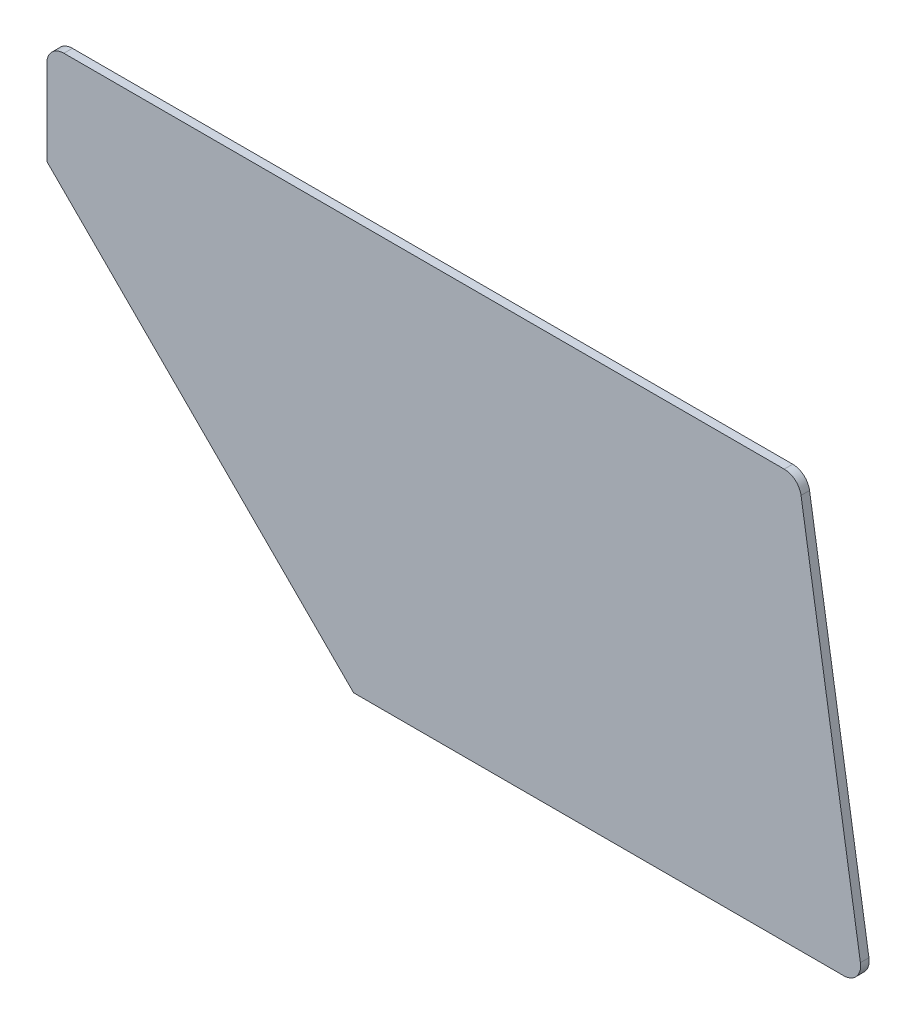
ISO-10303-21;
HEADER;
FILE_DESCRIPTION(('STEP AP214'),'2;1');
FILE_NAME('part.step','',(''),(''),'','','');
FILE_SCHEMA(('AUTOMOTIVE_DESIGN { 1 0 10303 214 1 1 1 1 }'));
ENDSEC;
DATA;
#1=APPLICATION_CONTEXT('core data for automotive mechanical design processes');
#2=APPLICATION_PROTOCOL_DEFINITION('international standard','automotive_design',2000,#1);
#3=PRODUCT_CONTEXT('',#1,'mechanical');
#4=PRODUCT('Part','Part','',(#3));
#5=PRODUCT_RELATED_PRODUCT_CATEGORY('part','',(#4));
#6=PRODUCT_DEFINITION_FORMATION('','',#4);
#7=PRODUCT_DEFINITION_CONTEXT('part definition',#1,'design');
#8=PRODUCT_DEFINITION('design','',#6,#7);
#9=PRODUCT_DEFINITION_SHAPE('','',#8);
#10=(LENGTH_UNIT() NAMED_UNIT(*) SI_UNIT(.MILLI.,.METRE.));
#11=(NAMED_UNIT(*) PLANE_ANGLE_UNIT() SI_UNIT($,.RADIAN.));
#12=(NAMED_UNIT(*) SI_UNIT($,.STERADIAN.) SOLID_ANGLE_UNIT());
#13=UNCERTAINTY_MEASURE_WITH_UNIT(LENGTH_MEASURE(1.E-05),#10,'distance_accuracy_value','');
#14=(GEOMETRIC_REPRESENTATION_CONTEXT(3) GLOBAL_UNCERTAINTY_ASSIGNED_CONTEXT((#13)) GLOBAL_UNIT_ASSIGNED_CONTEXT((#10,
#11,#12)) REPRESENTATION_CONTEXT('',''));
#15=CARTESIAN_POINT('',(0.,0.,0.));
#16=DIRECTION('',(0.,0.,1.));
#17=DIRECTION('',(1.,0.,0.));
#18=AXIS2_PLACEMENT_3D('',#15,#16,#17);
#19=CARTESIAN_POINT('',(0.,-38.1,3.175));
#20=DIRECTION('',(0.707106781186549,0.707106781186546,0.));
#21=DIRECTION('',(-0.707106781186546,0.707106781186549,0.));
#22=AXIS2_PLACEMENT_3D('',#19,#20,#21);
#23=PLANE('',#22);
#24=DIRECTION('',(0.707106781186546,-0.707106781186549,0.));
#25=VECTOR('',#24,1.);
#26=CARTESIAN_POINT('',(0.,-38.1,0.));
#27=LINE('',#26,#25);
#28=CARTESIAN_POINT('',(0.,-38.1,0.));
#29=VERTEX_POINT('',#28);
#30=CARTESIAN_POINT('',(114.3,-152.4,0.));
#31=VERTEX_POINT('',#30);
#32=EDGE_CURVE('E129',#29,#31,#27,.T.);
#33=ORIENTED_EDGE('',*,*,#32,.T.);
#34=DIRECTION('',(0.,0.,-1.));
#35=VECTOR('',#34,1.);
#36=CARTESIAN_POINT('',(114.3,-152.4,3.175));
#37=LINE('',#36,#35);
#38=CARTESIAN_POINT('',(114.3,-152.4,3.175));
#39=VERTEX_POINT('',#38);
#40=EDGE_CURVE('E11',#39,#31,#37,.T.);
#41=ORIENTED_EDGE('',*,*,#40,.F.);
#42=DIRECTION('',(0.707106781186546,-0.707106781186549,0.));
#43=VECTOR('',#42,1.);
#44=CARTESIAN_POINT('',(0.,-38.1,3.175));
#45=LINE('',#44,#43);
#46=CARTESIAN_POINT('',(0.,-38.1,3.175));
#47=VERTEX_POINT('',#46);
#48=EDGE_CURVE('E143',#47,#39,#45,.T.);
#49=ORIENTED_EDGE('',*,*,#48,.F.);
#50=DIRECTION('',(0.,0.,-1.));
#51=VECTOR('',#50,1.);
#52=CARTESIAN_POINT('',(0.,-38.1,3.175));
#53=LINE('',#52,#51);
#54=EDGE_CURVE('E125',#47,#29,#53,.T.);
#55=ORIENTED_EDGE('',*,*,#54,.T.);
#56=EDGE_LOOP('',(#33,#41,#49,#55));
#57=FACE_BOUND('',#56,.T.);
#58=ADVANCED_FACE('F33',(#57),#23,.F.);
#59=CARTESIAN_POINT('',(114.3,-152.4,3.175));
#60=DIRECTION('',(0.,1.,0.));
#61=DIRECTION('',(-1.,0.,0.));
#62=AXIS2_PLACEMENT_3D('',#59,#60,#61);
#63=PLANE('',#62);
#64=DIRECTION('',(1.,0.,0.));
#65=VECTOR('',#64,1.);
#66=CARTESIAN_POINT('',(114.3,-152.4,0.));
#67=LINE('',#66,#65);
#68=CARTESIAN_POINT('',(296.8625,-152.4,0.));
#69=VERTEX_POINT('',#68);
#70=EDGE_CURVE('E132',#31,#69,#67,.T.);
#71=ORIENTED_EDGE('',*,*,#70,.T.);
#72=DIRECTION('',(0.,0.,-1.));
#73=VECTOR('',#72,1.);
#74=CARTESIAN_POINT('',(296.8625,-152.4,3.175));
#75=LINE('',#74,#73);
#76=CARTESIAN_POINT('',(296.8625,-152.4,3.175));
#77=VERTEX_POINT('',#76);
#78=EDGE_CURVE('E41',#77,#69,#75,.T.);
#79=ORIENTED_EDGE('',*,*,#78,.F.);
#80=DIRECTION('',(1.,0.,0.));
#81=VECTOR('',#80,1.);
#82=CARTESIAN_POINT('',(114.3,-152.4,3.175));
#83=LINE('',#82,#81);
#84=EDGE_CURVE('E92',#39,#77,#83,.T.);
#85=ORIENTED_EDGE('',*,*,#84,.F.);
#86=ORIENTED_EDGE('',*,*,#40,.T.);
#87=EDGE_LOOP('',(#71,#79,#85,#86));
#88=FACE_BOUND('',#87,.T.);
#89=ADVANCED_FACE('F178',(#88),#63,.F.);
#90=CARTESIAN_POINT('',(296.8625,-146.05,3.175));
#91=DIRECTION('',(0.,0.,-1.));
#92=DIRECTION('',(-1.,0.,0.));
#93=AXIS2_PLACEMENT_3D('',#90,#91,#92);
#94=CYLINDRICAL_SURFACE('',#93,6.34999999999993);
#95=CARTESIAN_POINT('',(296.8625,-146.05,0.));
#96=DIRECTION('',(0.,0.,1.));
#97=DIRECTION('',(1.,0.,0.));
#98=AXIS2_PLACEMENT_3D('',#95,#96,#97);
#99=CIRCLE('',#98,6.34999999999993);
#100=CARTESIAN_POINT('',(303.134320962779,-145.056641146995,0.));
#101=VERTEX_POINT('',#100);
#102=EDGE_CURVE('E134',#69,#101,#99,.T.);
#103=ORIENTED_EDGE('',*,*,#102,.T.);
#104=DIRECTION('',(0.,0.,-1.));
#105=VECTOR('',#104,1.);
#106=CARTESIAN_POINT('',(303.134320962779,-145.056641146995,3.175));
#107=LINE('',#106,#105);
#108=CARTESIAN_POINT('',(303.134320962779,-145.056641146995,3.175));
#109=VERTEX_POINT('',#108);
#110=EDGE_CURVE('E150',#109,#101,#107,.T.);
#111=ORIENTED_EDGE('',*,*,#110,.F.);
#112=CARTESIAN_POINT('',(296.8625,-146.05,3.175));
#113=DIRECTION('',(0.,0.,1.));
#114=DIRECTION('',(1.,0.,0.));
#115=AXIS2_PLACEMENT_3D('',#112,#113,#114);
#116=CIRCLE('',#115,6.34999999999993);
#117=EDGE_CURVE('E158',#77,#109,#116,.T.);
#118=ORIENTED_EDGE('',*,*,#117,.F.);
#119=ORIENTED_EDGE('',*,*,#78,.T.);
#120=EDGE_LOOP('',(#103,#111,#118,#119));
#121=FACE_BOUND('',#120,.T.);
#122=ADVANCED_FACE('F156',(#121),#94,.T.);
#123=CARTESIAN_POINT('',(303.134320962779,-145.056641146995,3.175));
#124=DIRECTION('',(-0.987688340595137,-0.156434465040235,0.));
#125=DIRECTION('',(0.156434465040235,-0.987688340595137,0.));
#126=AXIS2_PLACEMENT_3D('',#123,#124,#125);
#127=PLANE('',#126);
#128=DIRECTION('',(-0.156434465040235,0.987688340595137,0.));
#129=VECTOR('',#128,1.);
#130=CARTESIAN_POINT('',(303.134320962779,-145.056641146995,0.));
#131=LINE('',#130,#129);
#132=CARTESIAN_POINT('',(281.008014649441,-5.35664114699449,0.));
#133=VERTEX_POINT('',#132);
#134=EDGE_CURVE('E136',#101,#133,#131,.T.);
#135=ORIENTED_EDGE('',*,*,#134,.T.);
#136=DIRECTION('',(0.,0.,-1.));
#137=VECTOR('',#136,1.);
#138=CARTESIAN_POINT('',(281.008014649441,-5.35664114699449,3.175));
#139=LINE('',#138,#137);
#140=CARTESIAN_POINT('',(281.008014649441,-5.35664114699449,3.175));
#141=VERTEX_POINT('',#140);
#142=EDGE_CURVE('E147',#141,#133,#139,.T.);
#143=ORIENTED_EDGE('',*,*,#142,.F.);
#144=DIRECTION('',(-0.156434465040235,0.987688340595137,0.));
#145=VECTOR('',#144,1.);
#146=CARTESIAN_POINT('',(303.134320962779,-145.056641146995,3.175));
#147=LINE('',#146,#145);
#148=EDGE_CURVE('E170',#109,#141,#147,.T.);
#149=ORIENTED_EDGE('',*,*,#148,.F.);
#150=ORIENTED_EDGE('',*,*,#110,.T.);
#151=EDGE_LOOP('',(#135,#143,#149,#150));
#152=FACE_BOUND('',#151,.T.);
#153=ADVANCED_FACE('F166',(#152),#127,.F.);
#154=CARTESIAN_POINT('',(274.736193686662,-6.34999999999997,3.175));
#155=DIRECTION('',(0.,0.,-1.));
#156=DIRECTION('',(-1.,0.,0.));
#157=AXIS2_PLACEMENT_3D('',#154,#155,#156);
#158=CYLINDRICAL_SURFACE('',#157,6.34999999999993);
#159=CARTESIAN_POINT('',(274.736193686662,-6.34999999999997,0.));
#160=DIRECTION('',(0.,0.,1.));
#161=DIRECTION('',(-1.,0.,0.));
#162=AXIS2_PLACEMENT_3D('',#159,#160,#161);
#163=CIRCLE('',#162,6.34999999999993);
#164=CARTESIAN_POINT('',(274.736193686662,0.,0.));
#165=VERTEX_POINT('',#164);
#166=EDGE_CURVE('E138',#133,#165,#163,.T.);
#167=ORIENTED_EDGE('',*,*,#166,.T.);
#168=DIRECTION('',(0.,0.,-1.));
#169=VECTOR('',#168,1.);
#170=CARTESIAN_POINT('',(274.736193686662,0.,3.175));
#171=LINE('',#170,#169);
#172=CARTESIAN_POINT('',(274.736193686662,0.,3.175));
#173=VERTEX_POINT('',#172);
#174=EDGE_CURVE('E120',#173,#165,#171,.T.);
#175=ORIENTED_EDGE('',*,*,#174,.F.);
#176=CARTESIAN_POINT('',(274.736193686662,-6.34999999999997,3.175));
#177=DIRECTION('',(0.,0.,1.));
#178=DIRECTION('',(-1.,0.,0.));
#179=AXIS2_PLACEMENT_3D('',#176,#177,#178);
#180=CIRCLE('',#179,6.34999999999993);
#181=EDGE_CURVE('E111',#141,#173,#180,.T.);
#182=ORIENTED_EDGE('',*,*,#181,.F.);
#183=ORIENTED_EDGE('',*,*,#142,.T.);
#184=EDGE_LOOP('',(#167,#175,#182,#183));
#185=FACE_BOUND('',#184,.T.);
#186=ADVANCED_FACE('F169',(#185),#158,.T.);
#187=CARTESIAN_POINT('',(274.736193686662,0.,3.175));
#188=DIRECTION('',(0.,-1.,0.));
#189=DIRECTION('',(1.,0.,0.));
#190=AXIS2_PLACEMENT_3D('',#187,#188,#189);
#191=PLANE('',#190);
#192=DIRECTION('',(-1.,0.,0.));
#193=VECTOR('',#192,1.);
#194=CARTESIAN_POINT('',(274.736193686662,0.,0.));
#195=LINE('',#194,#193);
#196=CARTESIAN_POINT('',(6.35000000000004,0.,0.));
#197=VERTEX_POINT('',#196);
#198=EDGE_CURVE('E119',#165,#197,#195,.T.);
#199=ORIENTED_EDGE('',*,*,#198,.T.);
#200=DIRECTION('',(0.,0.,-1.));
#201=VECTOR('',#200,1.);
#202=CARTESIAN_POINT('',(6.35000000000004,0.,3.175));
#203=LINE('',#202,#201);
#204=CARTESIAN_POINT('',(6.35000000000004,0.,3.175));
#205=VERTEX_POINT('',#204);
#206=EDGE_CURVE('E116',#205,#197,#203,.T.);
#207=ORIENTED_EDGE('',*,*,#206,.F.);
#208=DIRECTION('',(-1.,0.,0.));
#209=VECTOR('',#208,1.);
#210=CARTESIAN_POINT('',(274.736193686662,0.,3.175));
#211=LINE('',#210,#209);
#212=EDGE_CURVE('E105',#173,#205,#211,.T.);
#213=ORIENTED_EDGE('',*,*,#212,.F.);
#214=ORIENTED_EDGE('',*,*,#174,.T.);
#215=EDGE_LOOP('',(#199,#207,#213,#214));
#216=FACE_BOUND('',#215,.T.);
#217=ADVANCED_FACE('F117',(#216),#191,.F.);
#218=CARTESIAN_POINT('',(6.35,-6.35,3.175));
#219=DIRECTION('',(0.,0.,-1.));
#220=DIRECTION('',(-1.,0.,0.));
#221=AXIS2_PLACEMENT_3D('',#218,#219,#220);
#222=CYLINDRICAL_SURFACE('',#221,6.35);
#223=CARTESIAN_POINT('',(6.35,-6.35,0.));
#224=DIRECTION('',(0.,0.,1.));
#225=DIRECTION('',(1.,0.,0.));
#226=AXIS2_PLACEMENT_3D('',#223,#224,#225);
#227=CIRCLE('',#226,6.35);
#228=CARTESIAN_POINT('',(0.,-6.35000000000004,0.));
#229=VERTEX_POINT('',#228);
#230=EDGE_CURVE('E78',#197,#229,#227,.T.);
#231=ORIENTED_EDGE('',*,*,#230,.T.);
#232=DIRECTION('',(0.,0.,-1.));
#233=VECTOR('',#232,1.);
#234=CARTESIAN_POINT('',(0.,-6.35000000000004,3.175));
#235=LINE('',#234,#233);
#236=CARTESIAN_POINT('',(0.,-6.35000000000004,3.175));
#237=VERTEX_POINT('',#236);
#238=EDGE_CURVE('E121',#237,#229,#235,.T.);
#239=ORIENTED_EDGE('',*,*,#238,.F.);
#240=CARTESIAN_POINT('',(6.35,-6.35,3.175));
#241=DIRECTION('',(0.,0.,1.));
#242=DIRECTION('',(1.,0.,0.));
#243=AXIS2_PLACEMENT_3D('',#240,#241,#242);
#244=CIRCLE('',#243,6.35);
#245=EDGE_CURVE('E109',#205,#237,#244,.T.);
#246=ORIENTED_EDGE('',*,*,#245,.F.);
#247=ORIENTED_EDGE('',*,*,#206,.T.);
#248=EDGE_LOOP('',(#231,#239,#246,#247));
#249=FACE_BOUND('',#248,.T.);
#250=ADVANCED_FACE('F123',(#249),#222,.T.);
#251=CARTESIAN_POINT('',(0.,-6.35000000000004,3.175));
#252=DIRECTION('',(1.,0.,0.));
#253=DIRECTION('',(0.,0.,-1.));
#254=AXIS2_PLACEMENT_3D('',#251,#252,#253);
#255=PLANE('',#254);
#256=DIRECTION('',(0.,-1.,0.));
#257=VECTOR('',#256,1.);
#258=CARTESIAN_POINT('',(0.,-6.35000000000004,0.));
#259=LINE('',#258,#257);
#260=EDGE_CURVE('E84',#229,#29,#259,.T.);
#261=ORIENTED_EDGE('',*,*,#260,.T.);
#262=ORIENTED_EDGE('',*,*,#54,.F.);
#263=DIRECTION('',(0.,-1.,0.));
#264=VECTOR('',#263,1.);
#265=CARTESIAN_POINT('',(0.,-6.35000000000004,3.175));
#266=LINE('',#265,#264);
#267=EDGE_CURVE('E49',#237,#47,#266,.T.);
#268=ORIENTED_EDGE('',*,*,#267,.F.);
#269=ORIENTED_EDGE('',*,*,#238,.T.);
#270=EDGE_LOOP('',(#261,#262,#268,#269));
#271=FACE_BOUND('',#270,.T.);
#272=ADVANCED_FACE('F194',(#271),#255,.F.);
#273=CARTESIAN_POINT('',(296.8625,-146.05,3.175));
#274=DIRECTION('',(0.,0.,1.));
#275=DIRECTION('',(1.,0.,0.));
#276=AXIS2_PLACEMENT_3D('',#273,#274,#275);
#277=PLANE('',#276);
#278=ORIENTED_EDGE('',*,*,#48,.T.);
#279=ORIENTED_EDGE('',*,*,#84,.T.);
#280=ORIENTED_EDGE('',*,*,#117,.T.);
#281=ORIENTED_EDGE('',*,*,#148,.T.);
#282=ORIENTED_EDGE('',*,*,#181,.T.);
#283=ORIENTED_EDGE('',*,*,#212,.T.);
#284=ORIENTED_EDGE('',*,*,#245,.T.);
#285=ORIENTED_EDGE('',*,*,#267,.T.);
#286=EDGE_LOOP('',(#278,#279,#280,#281,#282,#283,#284,#285));
#287=FACE_BOUND('',#286,.T.);
#288=ADVANCED_FACE('F107',(#287),#277,.T.);
#289=CARTESIAN_POINT('',(296.8625,-146.05,0.));
#290=DIRECTION('',(0.,0.,1.));
#291=DIRECTION('',(1.,0.,0.));
#292=AXIS2_PLACEMENT_3D('',#289,#290,#291);
#293=PLANE('',#292);
#294=ORIENTED_EDGE('',*,*,#32,.F.);
#295=ORIENTED_EDGE('',*,*,#260,.F.);
#296=ORIENTED_EDGE('',*,*,#230,.F.);
#297=ORIENTED_EDGE('',*,*,#198,.F.);
#298=ORIENTED_EDGE('',*,*,#166,.F.);
#299=ORIENTED_EDGE('',*,*,#134,.F.);
#300=ORIENTED_EDGE('',*,*,#102,.F.);
#301=ORIENTED_EDGE('',*,*,#70,.F.);
#302=EDGE_LOOP('',(#294,#295,#296,#297,#298,#299,#300,#301));
#303=FACE_BOUND('',#302,.T.);
#304=ADVANCED_FACE('F162',(#303),#293,.F.);
#305=CLOSED_SHELL('',(#58,#89,#122,#153,#186,#217,#250,#272,#288,#304));
#306=MANIFOLD_SOLID_BREP('B2',#305);
#307=ADVANCED_BREP_SHAPE_REPRESENTATION('',(#18,#306),#14);
#308=SHAPE_DEFINITION_REPRESENTATION(#9,#307);
ENDSEC;
END-ISO-10303-21;
